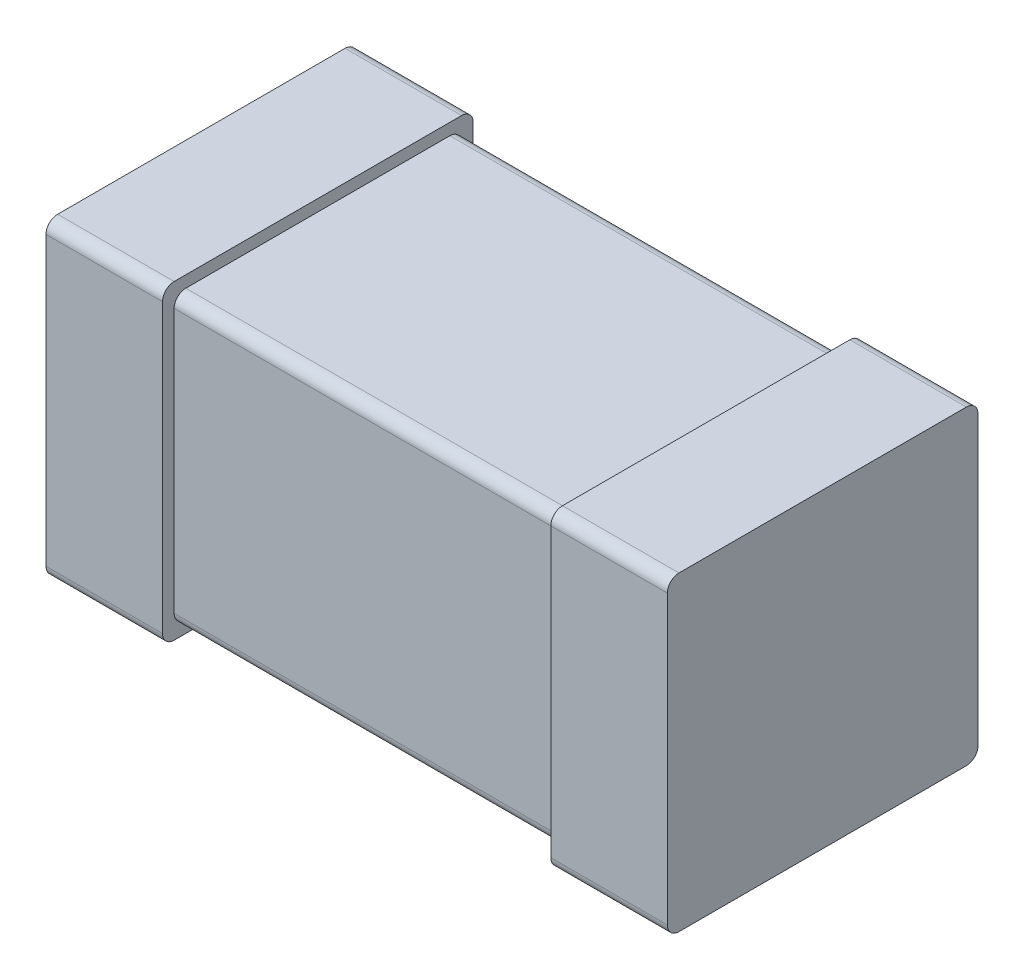
ISO-10303-21;
HEADER;
FILE_DESCRIPTION(('STEP AP214'),'2;1');
FILE_NAME('part.step','',(''),(''),'','','');
FILE_SCHEMA(('AUTOMOTIVE_DESIGN { 1 0 10303 214 1 1 1 1 }'));
ENDSEC;
DATA;
#1=APPLICATION_CONTEXT('core data for automotive mechanical design processes');
#2=APPLICATION_PROTOCOL_DEFINITION('international standard','automotive_design',2000,#1);
#3=PRODUCT_CONTEXT('',#1,'mechanical');
#4=PRODUCT('Part','Part','',(#3));
#5=PRODUCT_RELATED_PRODUCT_CATEGORY('part','',(#4));
#6=PRODUCT_DEFINITION_FORMATION('','',#4);
#7=PRODUCT_DEFINITION_CONTEXT('part definition',#1,'design');
#8=PRODUCT_DEFINITION('design','',#6,#7);
#9=PRODUCT_DEFINITION_SHAPE('','',#8);
#10=(LENGTH_UNIT() NAMED_UNIT(*) SI_UNIT(.MILLI.,.METRE.));
#11=(NAMED_UNIT(*) PLANE_ANGLE_UNIT() SI_UNIT($,.RADIAN.));
#12=(NAMED_UNIT(*) SI_UNIT($,.STERADIAN.) SOLID_ANGLE_UNIT());
#13=UNCERTAINTY_MEASURE_WITH_UNIT(LENGTH_MEASURE(1.E-05),#10,'distance_accuracy_value','');
#14=(GEOMETRIC_REPRESENTATION_CONTEXT(3) GLOBAL_UNCERTAINTY_ASSIGNED_CONTEXT((#13)) GLOBAL_UNIT_ASSIGNED_CONTEXT((#10,
#11,#12)) REPRESENTATION_CONTEXT('',''));
#15=CARTESIAN_POINT('',(0.,0.,0.));
#16=DIRECTION('',(0.,0.,1.));
#17=DIRECTION('',(1.,0.,0.));
#18=AXIS2_PLACEMENT_3D('',#15,#16,#17);
#19=CARTESIAN_POINT('',(0.8,-0.4,0.));
#20=DIRECTION('',(1.,0.,0.));
#21=DIRECTION('',(0.,1.,0.));
#22=AXIS2_PLACEMENT_3D('',#19,#20,#21);
#23=PLANE('',#22);
#24=DIRECTION('',(0.,0.,1.));
#25=VECTOR('',#24,1.);
#26=CARTESIAN_POINT('',(0.8,-0.4,0.));
#27=LINE('',#26,#25);
#28=CARTESIAN_POINT('',(0.8,-0.4,0.03));
#29=VERTEX_POINT('',#28);
#30=CARTESIAN_POINT('',(0.8,-0.4,0.77));
#31=VERTEX_POINT('',#30);
#32=EDGE_CURVE('E300',#29,#31,#27,.T.);
#33=ORIENTED_EDGE('',*,*,#32,.F.);
#34=CARTESIAN_POINT('',(0.8,-0.37,0.03));
#35=DIRECTION('',(1.,0.,0.));
#36=DIRECTION('',(0.,0.,1.));
#37=AXIS2_PLACEMENT_3D('',#34,#35,#36);
#38=CIRCLE('',#37,0.03);
#39=CARTESIAN_POINT('',(0.8,-0.37,0.));
#40=VERTEX_POINT('',#39);
#41=EDGE_CURVE('E380',#29,#40,#38,.T.);
#42=ORIENTED_EDGE('',*,*,#41,.T.);
#43=DIRECTION('',(0.,1.,0.));
#44=VECTOR('',#43,1.);
#45=CARTESIAN_POINT('',(0.8,-0.4,0.));
#46=LINE('',#45,#44);
#47=CARTESIAN_POINT('',(0.8,0.37,0.));
#48=VERTEX_POINT('',#47);
#49=EDGE_CURVE('E406',#40,#48,#46,.T.);
#50=ORIENTED_EDGE('',*,*,#49,.T.);
#51=CARTESIAN_POINT('',(0.8,0.37,0.03));
#52=DIRECTION('',(-1.,0.,0.));
#53=DIRECTION('',(0.,0.,1.));
#54=AXIS2_PLACEMENT_3D('',#51,#52,#53);
#55=CIRCLE('',#54,0.03);
#56=CARTESIAN_POINT('',(0.8,0.4,0.03));
#57=VERTEX_POINT('',#56);
#58=EDGE_CURVE('E289',#57,#48,#55,.T.);
#59=ORIENTED_EDGE('',*,*,#58,.F.);
#60=DIRECTION('',(0.,0.,1.));
#61=VECTOR('',#60,1.);
#62=CARTESIAN_POINT('',(0.8,0.4,0.));
#63=LINE('',#62,#61);
#64=CARTESIAN_POINT('',(0.8,0.4,0.77));
#65=VERTEX_POINT('',#64);
#66=EDGE_CURVE('E11',#57,#65,#63,.T.);
#67=ORIENTED_EDGE('',*,*,#66,.T.);
#68=CARTESIAN_POINT('',(0.8,0.37,0.77));
#69=DIRECTION('',(1.,0.,0.));
#70=DIRECTION('',(0.,0.,1.));
#71=AXIS2_PLACEMENT_3D('',#68,#69,#70);
#72=CIRCLE('',#71,0.03);
#73=CARTESIAN_POINT('',(0.8,0.37,0.8));
#74=VERTEX_POINT('',#73);
#75=EDGE_CURVE('E20',#65,#74,#72,.T.);
#76=ORIENTED_EDGE('',*,*,#75,.T.);
#77=DIRECTION('',(0.,1.,0.));
#78=VECTOR('',#77,1.);
#79=CARTESIAN_POINT('',(0.8,-0.4,0.8));
#80=LINE('',#79,#78);
#81=CARTESIAN_POINT('',(0.8,-0.37,0.8));
#82=VERTEX_POINT('',#81);
#83=EDGE_CURVE('E407',#82,#74,#80,.T.);
#84=ORIENTED_EDGE('',*,*,#83,.F.);
#85=CARTESIAN_POINT('',(0.8,-0.37,0.77));
#86=DIRECTION('',(-1.,0.,0.));
#87=DIRECTION('',(0.,0.,1.));
#88=AXIS2_PLACEMENT_3D('',#85,#86,#87);
#89=CIRCLE('',#88,0.03);
#90=EDGE_CURVE('E391',#31,#82,#89,.T.);
#91=ORIENTED_EDGE('',*,*,#90,.F.);
#92=EDGE_LOOP('',(#33,#42,#50,#59,#67,#76,#84,#91));
#93=FACE_BOUND('',#92,.T.);
#94=ADVANCED_FACE('F17',(#93),#23,.T.);
#95=CARTESIAN_POINT('',(0.5,0.4,0.));
#96=DIRECTION('',(0.,1.,0.));
#97=DIRECTION('',(1.,0.,0.));
#98=AXIS2_PLACEMENT_3D('',#95,#96,#97);
#99=PLANE('',#98);
#100=ORIENTED_EDGE('',*,*,#66,.F.);
#101=DIRECTION('',(1.,0.,0.));
#102=VECTOR('',#101,1.);
#103=CARTESIAN_POINT('',(0.5,0.4,0.03));
#104=LINE('',#103,#102);
#105=CARTESIAN_POINT('',(0.5,0.4,0.03));
#106=VERTEX_POINT('',#105);
#107=EDGE_CURVE('E285',#106,#57,#104,.T.);
#108=ORIENTED_EDGE('',*,*,#107,.F.);
#109=DIRECTION('',(0.,0.,1.));
#110=VECTOR('',#109,1.);
#111=CARTESIAN_POINT('',(0.5,0.4,0.));
#112=LINE('',#111,#110);
#113=CARTESIAN_POINT('',(0.5,0.4,0.77));
#114=VERTEX_POINT('',#113);
#115=EDGE_CURVE('E369',#106,#114,#112,.T.);
#116=ORIENTED_EDGE('',*,*,#115,.T.);
#117=DIRECTION('',(1.,0.,0.));
#118=VECTOR('',#117,1.);
#119=CARTESIAN_POINT('',(0.5,0.4,0.77));
#120=LINE('',#119,#118);
#121=EDGE_CURVE('E26',#114,#65,#120,.T.);
#122=ORIENTED_EDGE('',*,*,#121,.T.);
#123=EDGE_LOOP('',(#100,#108,#116,#122));
#124=FACE_BOUND('',#123,.T.);
#125=ADVANCED_FACE('F569',(#124),#99,.T.);
#126=CARTESIAN_POINT('',(0.5,0.37,0.77));
#127=DIRECTION('',(1.,0.,0.));
#128=DIRECTION('',(0.,1.,0.));
#129=AXIS2_PLACEMENT_3D('',#126,#127,#128);
#130=CYLINDRICAL_SURFACE('',#129,0.03);
#131=CARTESIAN_POINT('',(0.5,0.37,0.77));
#132=DIRECTION('',(1.,0.,0.));
#133=DIRECTION('',(0.,0.,1.));
#134=AXIS2_PLACEMENT_3D('',#131,#132,#133);
#135=CIRCLE('',#134,0.03);
#136=CARTESIAN_POINT('',(0.5,0.37,0.8));
#137=VERTEX_POINT('',#136);
#138=EDGE_CURVE('E365',#114,#137,#135,.T.);
#139=ORIENTED_EDGE('',*,*,#138,.T.);
#140=DIRECTION('',(1.,0.,0.));
#141=VECTOR('',#140,1.);
#142=CARTESIAN_POINT('',(0.5,0.37,0.8));
#143=LINE('',#142,#141);
#144=EDGE_CURVE('E290',#137,#74,#143,.T.);
#145=ORIENTED_EDGE('',*,*,#144,.T.);
#146=ORIENTED_EDGE('',*,*,#75,.F.);
#147=ORIENTED_EDGE('',*,*,#121,.F.);
#148=EDGE_LOOP('',(#139,#145,#146,#147));
#149=FACE_BOUND('',#148,.T.);
#150=ADVANCED_FACE('F573',(#149),#130,.T.);
#151=CARTESIAN_POINT('',(0.5,0.37,0.03));
#152=DIRECTION('',(1.,0.,0.));
#153=DIRECTION('',(0.,1.,0.));
#154=AXIS2_PLACEMENT_3D('',#151,#152,#153);
#155=CYLINDRICAL_SURFACE('',#154,0.03);
#156=ORIENTED_EDGE('',*,*,#107,.T.);
#157=ORIENTED_EDGE('',*,*,#58,.T.);
#158=DIRECTION('',(1.,0.,0.));
#159=VECTOR('',#158,1.);
#160=CARTESIAN_POINT('',(0.5,0.37,0.));
#161=LINE('',#160,#159);
#162=CARTESIAN_POINT('',(0.5,0.37,0.));
#163=VERTEX_POINT('',#162);
#164=EDGE_CURVE('E402',#163,#48,#161,.T.);
#165=ORIENTED_EDGE('',*,*,#164,.F.);
#166=CARTESIAN_POINT('',(0.5,0.37,0.03));
#167=DIRECTION('',(-1.,0.,0.));
#168=DIRECTION('',(0.,0.,1.));
#169=AXIS2_PLACEMENT_3D('',#166,#167,#168);
#170=CIRCLE('',#169,0.03);
#171=EDGE_CURVE('E340',#106,#163,#170,.T.);
#172=ORIENTED_EDGE('',*,*,#171,.F.);
#173=EDGE_LOOP('',(#156,#157,#165,#172));
#174=FACE_BOUND('',#173,.T.);
#175=ADVANCED_FACE('F585',(#174),#155,.T.);
#176=CARTESIAN_POINT('',(0.5,-0.4,0.8));
#177=DIRECTION('',(0.,0.,1.));
#178=DIRECTION('',(1.,0.,0.));
#179=AXIS2_PLACEMENT_3D('',#176,#177,#178);
#180=PLANE('',#179);
#181=DIRECTION('',(0.,1.,0.));
#182=VECTOR('',#181,1.);
#183=CARTESIAN_POINT('',(0.5,-0.4,0.8));
#184=LINE('',#183,#182);
#185=CARTESIAN_POINT('',(0.5,-0.37,0.8));
#186=VERTEX_POINT('',#185);
#187=EDGE_CURVE('E361',#186,#137,#184,.T.);
#188=ORIENTED_EDGE('',*,*,#187,.F.);
#189=DIRECTION('',(1.,0.,0.));
#190=VECTOR('',#189,1.);
#191=CARTESIAN_POINT('',(0.5,-0.37,0.8));
#192=LINE('',#191,#190);
#193=EDGE_CURVE('E395',#186,#82,#192,.T.);
#194=ORIENTED_EDGE('',*,*,#193,.T.);
#195=ORIENTED_EDGE('',*,*,#83,.T.);
#196=ORIENTED_EDGE('',*,*,#144,.F.);
#197=EDGE_LOOP('',(#188,#194,#195,#196));
#198=FACE_BOUND('',#197,.T.);
#199=ADVANCED_FACE('F591',(#198),#180,.T.);
#200=CARTESIAN_POINT('',(0.5,-0.4,0.));
#201=DIRECTION('',(0.,0.,1.));
#202=DIRECTION('',(1.,0.,0.));
#203=AXIS2_PLACEMENT_3D('',#200,#201,#202);
#204=PLANE('',#203);
#205=ORIENTED_EDGE('',*,*,#164,.T.);
#206=ORIENTED_EDGE('',*,*,#49,.F.);
#207=DIRECTION('',(1.,0.,0.));
#208=VECTOR('',#207,1.);
#209=CARTESIAN_POINT('',(0.5,-0.37,0.));
#210=LINE('',#209,#208);
#211=CARTESIAN_POINT('',(0.5,-0.37,0.));
#212=VERTEX_POINT('',#211);
#213=EDGE_CURVE('E304',#212,#40,#210,.T.);
#214=ORIENTED_EDGE('',*,*,#213,.F.);
#215=DIRECTION('',(0.,1.,0.));
#216=VECTOR('',#215,1.);
#217=CARTESIAN_POINT('',(0.5,-0.4,0.));
#218=LINE('',#217,#216);
#219=EDGE_CURVE('E335',#212,#163,#218,.T.);
#220=ORIENTED_EDGE('',*,*,#219,.T.);
#221=EDGE_LOOP('',(#205,#206,#214,#220));
#222=FACE_BOUND('',#221,.T.);
#223=ADVANCED_FACE('F583',(#222),#204,.F.);
#224=CARTESIAN_POINT('',(0.5,-0.37,0.77));
#225=DIRECTION('',(1.,0.,0.));
#226=DIRECTION('',(0.,-1.,0.));
#227=AXIS2_PLACEMENT_3D('',#224,#225,#226);
#228=CYLINDRICAL_SURFACE('',#227,0.03);
#229=DIRECTION('',(1.,0.,0.));
#230=VECTOR('',#229,1.);
#231=CARTESIAN_POINT('',(0.5,-0.4,0.77));
#232=LINE('',#231,#230);
#233=CARTESIAN_POINT('',(0.5,-0.4,0.77));
#234=VERTEX_POINT('',#233);
#235=EDGE_CURVE('E384',#234,#31,#232,.T.);
#236=ORIENTED_EDGE('',*,*,#235,.T.);
#237=ORIENTED_EDGE('',*,*,#90,.T.);
#238=ORIENTED_EDGE('',*,*,#193,.F.);
#239=CARTESIAN_POINT('',(0.5,-0.37,0.77));
#240=DIRECTION('',(-1.,0.,0.));
#241=DIRECTION('',(0.,0.,1.));
#242=AXIS2_PLACEMENT_3D('',#239,#240,#241);
#243=CIRCLE('',#242,0.03);
#244=EDGE_CURVE('E357',#234,#186,#243,.T.);
#245=ORIENTED_EDGE('',*,*,#244,.F.);
#246=EDGE_LOOP('',(#236,#237,#238,#245));
#247=FACE_BOUND('',#246,.T.);
#248=ADVANCED_FACE('F594',(#247),#228,.T.);
#249=CARTESIAN_POINT('',(0.5,-0.37,0.03));
#250=DIRECTION('',(1.,0.,0.));
#251=DIRECTION('',(0.,-1.,0.));
#252=AXIS2_PLACEMENT_3D('',#249,#250,#251);
#253=CYLINDRICAL_SURFACE('',#252,0.03);
#254=CARTESIAN_POINT('',(0.5,-0.37,0.03));
#255=DIRECTION('',(1.,0.,0.));
#256=DIRECTION('',(0.,0.,1.));
#257=AXIS2_PLACEMENT_3D('',#254,#255,#256);
#258=CIRCLE('',#257,0.03);
#259=CARTESIAN_POINT('',(0.5,-0.4,0.03));
#260=VERTEX_POINT('',#259);
#261=EDGE_CURVE('E339',#260,#212,#258,.T.);
#262=ORIENTED_EDGE('',*,*,#261,.T.);
#263=ORIENTED_EDGE('',*,*,#213,.T.);
#264=ORIENTED_EDGE('',*,*,#41,.F.);
#265=DIRECTION('',(1.,0.,0.));
#266=VECTOR('',#265,1.);
#267=CARTESIAN_POINT('',(0.5,-0.4,0.03));
#268=LINE('',#267,#266);
#269=EDGE_CURVE('E305',#260,#29,#268,.T.);
#270=ORIENTED_EDGE('',*,*,#269,.F.);
#271=EDGE_LOOP('',(#262,#263,#264,#270));
#272=FACE_BOUND('',#271,.T.);
#273=ADVANCED_FACE('F580',(#272),#253,.T.);
#274=CARTESIAN_POINT('',(0.5,-0.4,0.));
#275=DIRECTION('',(0.,1.,0.));
#276=DIRECTION('',(1.,0.,0.));
#277=AXIS2_PLACEMENT_3D('',#274,#275,#276);
#278=PLANE('',#277);
#279=ORIENTED_EDGE('',*,*,#235,.F.);
#280=DIRECTION('',(0.,0.,1.));
#281=VECTOR('',#280,1.);
#282=CARTESIAN_POINT('',(0.5,-0.4,0.));
#283=LINE('',#282,#281);
#284=EDGE_CURVE('E376',#260,#234,#283,.T.);
#285=ORIENTED_EDGE('',*,*,#284,.F.);
#286=ORIENTED_EDGE('',*,*,#269,.T.);
#287=ORIENTED_EDGE('',*,*,#32,.T.);
#288=EDGE_LOOP('',(#279,#285,#286,#287));
#289=FACE_BOUND('',#288,.T.);
#290=ADVANCED_FACE('F577',(#289),#278,.F.);
#291=CARTESIAN_POINT('',(0.5,-0.4,0.));
#292=DIRECTION('',(1.,0.,0.));
#293=DIRECTION('',(0.,1.,0.));
#294=AXIS2_PLACEMENT_3D('',#291,#292,#293);
#295=PLANE('',#294);
#296=DIRECTION('',(0.,1.,0.));
#297=VECTOR('',#296,1.);
#298=CARTESIAN_POINT('',(0.5,-0.37,0.03));
#299=LINE('',#298,#297);
#300=CARTESIAN_POINT('',(0.5,-0.34,0.03));
#301=VERTEX_POINT('',#300);
#302=CARTESIAN_POINT('',(0.5,0.34,0.03));
#303=VERTEX_POINT('',#302);
#304=EDGE_CURVE('E310',#301,#303,#299,.T.);
#305=ORIENTED_EDGE('',*,*,#304,.T.);
#306=CARTESIAN_POINT('',(0.5,0.34,0.06));
#307=DIRECTION('',(-1.,0.,0.));
#308=DIRECTION('',(0.,0.,1.));
#309=AXIS2_PLACEMENT_3D('',#306,#307,#308);
#310=CIRCLE('',#309,0.03);
#311=CARTESIAN_POINT('',(0.5,0.37,0.06));
#312=VERTEX_POINT('',#311);
#313=EDGE_CURVE('E318',#312,#303,#310,.T.);
#314=ORIENTED_EDGE('',*,*,#313,.F.);
#315=DIRECTION('',(0.,0.,1.));
#316=VECTOR('',#315,1.);
#317=CARTESIAN_POINT('',(0.5,0.37,0.03));
#318=LINE('',#317,#316);
#319=CARTESIAN_POINT('',(0.5,0.37,0.74));
#320=VERTEX_POINT('',#319);
#321=EDGE_CURVE('E321',#312,#320,#318,.T.);
#322=ORIENTED_EDGE('',*,*,#321,.T.);
#323=CARTESIAN_POINT('',(0.5,0.34,0.74));
#324=DIRECTION('',(1.,0.,0.));
#325=DIRECTION('',(0.,0.,1.));
#326=AXIS2_PLACEMENT_3D('',#323,#324,#325);
#327=CIRCLE('',#326,0.03);
#328=CARTESIAN_POINT('',(0.5,0.34,0.77));
#329=VERTEX_POINT('',#328);
#330=EDGE_CURVE('E330',#320,#329,#327,.T.);
#331=ORIENTED_EDGE('',*,*,#330,.T.);
#332=DIRECTION('',(0.,1.,0.));
#333=VECTOR('',#332,1.);
#334=CARTESIAN_POINT('',(0.5,-0.37,0.77));
#335=LINE('',#334,#333);
#336=CARTESIAN_POINT('',(0.5,-0.34,0.77));
#337=VERTEX_POINT('',#336);
#338=EDGE_CURVE('E344',#337,#329,#335,.T.);
#339=ORIENTED_EDGE('',*,*,#338,.F.);
#340=CARTESIAN_POINT('',(0.5,-0.34,0.74));
#341=DIRECTION('',(-1.,0.,0.));
#342=DIRECTION('',(0.,0.,1.));
#343=AXIS2_PLACEMENT_3D('',#340,#341,#342);
#344=CIRCLE('',#343,0.03);
#345=CARTESIAN_POINT('',(0.5,-0.37,0.74));
#346=VERTEX_POINT('',#345);
#347=EDGE_CURVE('E351',#346,#337,#344,.T.);
#348=ORIENTED_EDGE('',*,*,#347,.F.);
#349=DIRECTION('',(0.,0.,1.));
#350=VECTOR('',#349,1.);
#351=CARTESIAN_POINT('',(0.5,-0.37,0.03));
#352=LINE('',#351,#350);
#353=CARTESIAN_POINT('',(0.5,-0.37,0.06));
#354=VERTEX_POINT('',#353);
#355=EDGE_CURVE('E354',#354,#346,#352,.T.);
#356=ORIENTED_EDGE('',*,*,#355,.F.);
#357=CARTESIAN_POINT('',(0.5,-0.34,0.06));
#358=DIRECTION('',(1.,0.,0.));
#359=DIRECTION('',(0.,0.,1.));
#360=AXIS2_PLACEMENT_3D('',#357,#358,#359);
#361=CIRCLE('',#360,0.03);
#362=EDGE_CURVE('E295',#354,#301,#361,.T.);
#363=ORIENTED_EDGE('',*,*,#362,.T.);
#364=EDGE_LOOP('',(#305,#314,#322,#331,#339,#348,#356,#363));
#365=FACE_BOUND('',#364,.T.);
#366=ORIENTED_EDGE('',*,*,#244,.T.);
#367=ORIENTED_EDGE('',*,*,#187,.T.);
#368=ORIENTED_EDGE('',*,*,#138,.F.);
#369=ORIENTED_EDGE('',*,*,#115,.F.);
#370=ORIENTED_EDGE('',*,*,#171,.T.);
#371=ORIENTED_EDGE('',*,*,#219,.F.);
#372=ORIENTED_EDGE('',*,*,#261,.F.);
#373=ORIENTED_EDGE('',*,*,#284,.T.);
#374=EDGE_LOOP('',(#366,#367,#368,#369,#370,#371,#372,#373));
#375=FACE_BOUND('',#374,.T.);
#376=ADVANCED_FACE('F541',(#365,#375),#295,.F.);
#377=CARTESIAN_POINT('',(-0.5,-0.37,0.03));
#378=DIRECTION('',(0.,1.,0.));
#379=DIRECTION('',(1.,0.,0.));
#380=AXIS2_PLACEMENT_3D('',#377,#378,#379);
#381=PLANE('',#380);
#382=DIRECTION('',(1.,0.,0.));
#383=VECTOR('',#382,1.);
#384=CARTESIAN_POINT('',(-0.5,-0.37,0.74));
#385=LINE('',#384,#383);
#386=CARTESIAN_POINT('',(-0.5,-0.37,0.74));
#387=VERTEX_POINT('',#386);
#388=EDGE_CURVE('E347',#387,#346,#385,.T.);
#389=ORIENTED_EDGE('',*,*,#388,.F.);
#390=DIRECTION('',(0.,0.,1.));
#391=VECTOR('',#390,1.);
#392=CARTESIAN_POINT('',(-0.5,-0.37,0.03));
#393=LINE('',#392,#391);
#394=CARTESIAN_POINT('',(-0.5,-0.37,0.06));
#395=VERTEX_POINT('',#394);
#396=EDGE_CURVE('E268',#395,#387,#393,.T.);
#397=ORIENTED_EDGE('',*,*,#396,.F.);
#398=DIRECTION('',(1.,0.,0.));
#399=VECTOR('',#398,1.);
#400=CARTESIAN_POINT('',(-0.5,-0.37,0.06));
#401=LINE('',#400,#399);
#402=EDGE_CURVE('E299',#395,#354,#401,.T.);
#403=ORIENTED_EDGE('',*,*,#402,.T.);
#404=ORIENTED_EDGE('',*,*,#355,.T.);
#405=EDGE_LOOP('',(#389,#397,#403,#404));
#406=FACE_BOUND('',#405,.T.);
#407=ADVANCED_FACE('F547',(#406),#381,.F.);
#408=CARTESIAN_POINT('',(-0.5,-0.34,0.74));
#409=DIRECTION('',(1.,0.,0.));
#410=DIRECTION('',(0.,-1.,0.));
#411=AXIS2_PLACEMENT_3D('',#408,#409,#410);
#412=CYLINDRICAL_SURFACE('',#411,0.03);
#413=ORIENTED_EDGE('',*,*,#388,.T.);
#414=ORIENTED_EDGE('',*,*,#347,.T.);
#415=DIRECTION('',(1.,0.,0.));
#416=VECTOR('',#415,1.);
#417=CARTESIAN_POINT('',(-0.5,-0.34,0.77));
#418=LINE('',#417,#416);
#419=CARTESIAN_POINT('',(-0.5,-0.34,0.77));
#420=VERTEX_POINT('',#419);
#421=EDGE_CURVE('E334',#420,#337,#418,.T.);
#422=ORIENTED_EDGE('',*,*,#421,.F.);
#423=CARTESIAN_POINT('',(-0.5,-0.34,0.74));
#424=DIRECTION('',(-1.,0.,0.));
#425=DIRECTION('',(0.,0.,1.));
#426=AXIS2_PLACEMENT_3D('',#423,#424,#425);
#427=CIRCLE('',#426,0.03);
#428=EDGE_CURVE('E263',#387,#420,#427,.T.);
#429=ORIENTED_EDGE('',*,*,#428,.F.);
#430=EDGE_LOOP('',(#413,#414,#422,#429));
#431=FACE_BOUND('',#430,.T.);
#432=ADVANCED_FACE('F551',(#431),#412,.T.);
#433=CARTESIAN_POINT('',(-0.5,-0.37,0.77));
#434=DIRECTION('',(0.,0.,1.));
#435=DIRECTION('',(1.,0.,0.));
#436=AXIS2_PLACEMENT_3D('',#433,#434,#435);
#437=PLANE('',#436);
#438=DIRECTION('',(0.,1.,0.));
#439=VECTOR('',#438,1.);
#440=CARTESIAN_POINT('',(-0.5,-0.37,0.77));
#441=LINE('',#440,#439);
#442=CARTESIAN_POINT('',(-0.5,0.34,0.77));
#443=VERTEX_POINT('',#442);
#444=EDGE_CURVE('E267',#420,#443,#441,.T.);
#445=ORIENTED_EDGE('',*,*,#444,.F.);
#446=ORIENTED_EDGE('',*,*,#421,.T.);
#447=ORIENTED_EDGE('',*,*,#338,.T.);
#448=DIRECTION('',(1.,0.,0.));
#449=VECTOR('',#448,1.);
#450=CARTESIAN_POINT('',(-0.5,0.34,0.77));
#451=LINE('',#450,#449);
#452=EDGE_CURVE('E329',#443,#329,#451,.T.);
#453=ORIENTED_EDGE('',*,*,#452,.F.);
#454=EDGE_LOOP('',(#445,#446,#447,#453));
#455=FACE_BOUND('',#454,.T.);
#456=ADVANCED_FACE('F553',(#455),#437,.T.);
#457=CARTESIAN_POINT('',(-0.5,0.34,0.74));
#458=DIRECTION('',(1.,0.,0.));
#459=DIRECTION('',(0.,1.,0.));
#460=AXIS2_PLACEMENT_3D('',#457,#458,#459);
#461=CYLINDRICAL_SURFACE('',#460,0.03);
#462=CARTESIAN_POINT('',(-0.5,0.34,0.74));
#463=DIRECTION('',(1.,0.,0.));
#464=DIRECTION('',(0.,0.,1.));
#465=AXIS2_PLACEMENT_3D('',#462,#463,#464);
#466=CIRCLE('',#465,0.03);
#467=CARTESIAN_POINT('',(-0.5,0.37,0.74));
#468=VERTEX_POINT('',#467);
#469=EDGE_CURVE('E272',#468,#443,#466,.T.);
#470=ORIENTED_EDGE('',*,*,#469,.T.);
#471=ORIENTED_EDGE('',*,*,#452,.T.);
#472=ORIENTED_EDGE('',*,*,#330,.F.);
#473=DIRECTION('',(1.,0.,0.));
#474=VECTOR('',#473,1.);
#475=CARTESIAN_POINT('',(-0.5,0.37,0.74));
#476=LINE('',#475,#474);
#477=EDGE_CURVE('E325',#468,#320,#476,.T.);
#478=ORIENTED_EDGE('',*,*,#477,.F.);
#479=EDGE_LOOP('',(#470,#471,#472,#478));
#480=FACE_BOUND('',#479,.T.);
#481=ADVANCED_FACE('F555',(#480),#461,.T.);
#482=CARTESIAN_POINT('',(-0.5,0.37,0.03));
#483=DIRECTION('',(0.,1.,0.));
#484=DIRECTION('',(1.,0.,0.));
#485=AXIS2_PLACEMENT_3D('',#482,#483,#484);
#486=PLANE('',#485);
#487=ORIENTED_EDGE('',*,*,#321,.F.);
#488=DIRECTION('',(1.,0.,0.));
#489=VECTOR('',#488,1.);
#490=CARTESIAN_POINT('',(-0.5,0.37,0.06));
#491=LINE('',#490,#489);
#492=CARTESIAN_POINT('',(-0.5,0.37,0.06));
#493=VERTEX_POINT('',#492);
#494=EDGE_CURVE('E314',#493,#312,#491,.T.);
#495=ORIENTED_EDGE('',*,*,#494,.F.);
#496=DIRECTION('',(0.,0.,1.));
#497=VECTOR('',#496,1.);
#498=CARTESIAN_POINT('',(-0.5,0.37,0.03));
#499=LINE('',#498,#497);
#500=EDGE_CURVE('E276',#493,#468,#499,.T.);
#501=ORIENTED_EDGE('',*,*,#500,.T.);
#502=ORIENTED_EDGE('',*,*,#477,.T.);
#503=EDGE_LOOP('',(#487,#495,#501,#502));
#504=FACE_BOUND('',#503,.T.);
#505=ADVANCED_FACE('F557',(#504),#486,.T.);
#506=CARTESIAN_POINT('',(-0.5,0.34,0.06));
#507=DIRECTION('',(1.,0.,0.));
#508=DIRECTION('',(0.,1.,0.));
#509=AXIS2_PLACEMENT_3D('',#506,#507,#508);
#510=CYLINDRICAL_SURFACE('',#509,0.03);
#511=ORIENTED_EDGE('',*,*,#494,.T.);
#512=ORIENTED_EDGE('',*,*,#313,.T.);
#513=DIRECTION('',(1.,0.,0.));
#514=VECTOR('',#513,1.);
#515=CARTESIAN_POINT('',(-0.5,0.34,0.03));
#516=LINE('',#515,#514);
#517=CARTESIAN_POINT('',(-0.5,0.34,0.03));
#518=VERTEX_POINT('',#517);
#519=EDGE_CURVE('E306',#518,#303,#516,.T.);
#520=ORIENTED_EDGE('',*,*,#519,.F.);
#521=CARTESIAN_POINT('',(-0.5,0.34,0.06));
#522=DIRECTION('',(-1.,0.,0.));
#523=DIRECTION('',(0.,0.,1.));
#524=AXIS2_PLACEMENT_3D('',#521,#522,#523);
#525=CIRCLE('',#524,0.03);
#526=EDGE_CURVE('E280',#493,#518,#525,.T.);
#527=ORIENTED_EDGE('',*,*,#526,.F.);
#528=EDGE_LOOP('',(#511,#512,#520,#527));
#529=FACE_BOUND('',#528,.T.);
#530=ADVANCED_FACE('F538',(#529),#510,.T.);
#531=CARTESIAN_POINT('',(-0.5,-0.37,0.03));
#532=DIRECTION('',(0.,0.,1.));
#533=DIRECTION('',(1.,0.,0.));
#534=AXIS2_PLACEMENT_3D('',#531,#532,#533);
#535=PLANE('',#534);
#536=ORIENTED_EDGE('',*,*,#519,.T.);
#537=ORIENTED_EDGE('',*,*,#304,.F.);
#538=DIRECTION('',(1.,0.,0.));
#539=VECTOR('',#538,1.);
#540=CARTESIAN_POINT('',(-0.5,-0.34,0.03));
#541=LINE('',#540,#539);
#542=CARTESIAN_POINT('',(-0.5,-0.34,0.03));
#543=VERTEX_POINT('',#542);
#544=EDGE_CURVE('E294',#543,#301,#541,.T.);
#545=ORIENTED_EDGE('',*,*,#544,.F.);
#546=DIRECTION('',(0.,1.,0.));
#547=VECTOR('',#546,1.);
#548=CARTESIAN_POINT('',(-0.5,-0.37,0.03));
#549=LINE('',#548,#547);
#550=EDGE_CURVE('E283',#543,#518,#549,.T.);
#551=ORIENTED_EDGE('',*,*,#550,.T.);
#552=EDGE_LOOP('',(#536,#537,#545,#551));
#553=FACE_BOUND('',#552,.T.);
#554=ADVANCED_FACE('F532',(#553),#535,.F.);
#555=CARTESIAN_POINT('',(-0.5,-0.34,0.06));
#556=DIRECTION('',(1.,0.,0.));
#557=DIRECTION('',(0.,-1.,0.));
#558=AXIS2_PLACEMENT_3D('',#555,#556,#557);
#559=CYLINDRICAL_SURFACE('',#558,0.03);
#560=CARTESIAN_POINT('',(-0.5,-0.34,0.06));
#561=DIRECTION('',(1.,0.,0.));
#562=DIRECTION('',(0.,0.,1.));
#563=AXIS2_PLACEMENT_3D('',#560,#561,#562);
#564=CIRCLE('',#563,0.03);
#565=EDGE_CURVE('E240',#395,#543,#564,.T.);
#566=ORIENTED_EDGE('',*,*,#565,.T.);
#567=ORIENTED_EDGE('',*,*,#544,.T.);
#568=ORIENTED_EDGE('',*,*,#362,.F.);
#569=ORIENTED_EDGE('',*,*,#402,.F.);
#570=EDGE_LOOP('',(#566,#567,#568,#569));
#571=FACE_BOUND('',#570,.T.);
#572=ADVANCED_FACE('F528',(#571),#559,.T.);
#573=CARTESIAN_POINT('',(-0.5,-0.4,0.));
#574=DIRECTION('',(1.,0.,0.));
#575=DIRECTION('',(0.,1.,0.));
#576=AXIS2_PLACEMENT_3D('',#573,#574,#575);
#577=PLANE('',#576);
#578=ORIENTED_EDGE('',*,*,#565,.F.);
#579=ORIENTED_EDGE('',*,*,#396,.T.);
#580=ORIENTED_EDGE('',*,*,#428,.T.);
#581=ORIENTED_EDGE('',*,*,#444,.T.);
#582=ORIENTED_EDGE('',*,*,#469,.F.);
#583=ORIENTED_EDGE('',*,*,#500,.F.);
#584=ORIENTED_EDGE('',*,*,#526,.T.);
#585=ORIENTED_EDGE('',*,*,#550,.F.);
#586=EDGE_LOOP('',(#578,#579,#580,#581,#582,#583,#584,#585));
#587=FACE_BOUND('',#586,.T.);
#588=DIRECTION('',(0.,0.,1.));
#589=VECTOR('',#588,1.);
#590=CARTESIAN_POINT('',(-0.5,-0.4,0.));
#591=LINE('',#590,#589);
#592=CARTESIAN_POINT('',(-0.5,-0.4,0.03));
#593=VERTEX_POINT('',#592);
#594=CARTESIAN_POINT('',(-0.5,-0.4,0.77));
#595=VERTEX_POINT('',#594);
#596=EDGE_CURVE('E450',#593,#595,#591,.T.);
#597=ORIENTED_EDGE('',*,*,#596,.F.);
#598=CARTESIAN_POINT('',(-0.5,-0.37,0.03));
#599=DIRECTION('',(1.,0.,0.));
#600=DIRECTION('',(0.,0.,1.));
#601=AXIS2_PLACEMENT_3D('',#598,#599,#600);
#602=CIRCLE('',#601,0.03);
#603=CARTESIAN_POINT('',(-0.5,-0.37,0.));
#604=VERTEX_POINT('',#603);
#605=EDGE_CURVE('E436',#593,#604,#602,.T.);
#606=ORIENTED_EDGE('',*,*,#605,.T.);
#607=DIRECTION('',(0.,1.,0.));
#608=VECTOR('',#607,1.);
#609=CARTESIAN_POINT('',(-0.5,-0.4,0.));
#610=LINE('',#609,#608);
#611=CARTESIAN_POINT('',(-0.5,0.37,0.));
#612=VERTEX_POINT('',#611);
#613=EDGE_CURVE('E488',#604,#612,#610,.T.);
#614=ORIENTED_EDGE('',*,*,#613,.T.);
#615=CARTESIAN_POINT('',(-0.5,0.37,0.03));
#616=DIRECTION('',(-1.,0.,0.));
#617=DIRECTION('',(0.,0.,1.));
#618=AXIS2_PLACEMENT_3D('',#615,#616,#617);
#619=CIRCLE('',#618,0.03);
#620=CARTESIAN_POINT('',(-0.5,0.4,0.03));
#621=VERTEX_POINT('',#620);
#622=EDGE_CURVE('E236',#621,#612,#619,.T.);
#623=ORIENTED_EDGE('',*,*,#622,.F.);
#624=DIRECTION('',(0.,0.,1.));
#625=VECTOR('',#624,1.);
#626=CARTESIAN_POINT('',(-0.5,0.4,0.));
#627=LINE('',#626,#625);
#628=CARTESIAN_POINT('',(-0.5,0.4,0.77));
#629=VERTEX_POINT('',#628);
#630=EDGE_CURVE('E228',#621,#629,#627,.T.);
#631=ORIENTED_EDGE('',*,*,#630,.T.);
#632=CARTESIAN_POINT('',(-0.5,0.37,0.77));
#633=DIRECTION('',(1.,0.,0.));
#634=DIRECTION('',(0.,0.,1.));
#635=AXIS2_PLACEMENT_3D('',#632,#633,#634);
#636=CIRCLE('',#635,0.03);
#637=CARTESIAN_POINT('',(-0.5,0.37,0.8));
#638=VERTEX_POINT('',#637);
#639=EDGE_CURVE('E233',#629,#638,#636,.T.);
#640=ORIENTED_EDGE('',*,*,#639,.T.);
#641=DIRECTION('',(0.,1.,0.));
#642=VECTOR('',#641,1.);
#643=CARTESIAN_POINT('',(-0.5,-0.4,0.8));
#644=LINE('',#643,#642);
#645=CARTESIAN_POINT('',(-0.5,-0.37,0.8));
#646=VERTEX_POINT('',#645);
#647=EDGE_CURVE('E497',#646,#638,#644,.T.);
#648=ORIENTED_EDGE('',*,*,#647,.F.);
#649=CARTESIAN_POINT('',(-0.5,-0.37,0.77));
#650=DIRECTION('',(-1.,0.,0.));
#651=DIRECTION('',(0.,0.,1.));
#652=AXIS2_PLACEMENT_3D('',#649,#650,#651);
#653=CIRCLE('',#652,0.03);
#654=EDGE_CURVE('E440',#595,#646,#653,.T.);
#655=ORIENTED_EDGE('',*,*,#654,.F.);
#656=EDGE_LOOP('',(#597,#606,#614,#623,#631,#640,#648,#655));
#657=FACE_BOUND('',#656,.T.);
#658=ADVANCED_FACE('F231',(#587,#657),#577,.T.);
#659=CARTESIAN_POINT('',(-0.8,0.4,0.));
#660=DIRECTION('',(0.,1.,0.));
#661=DIRECTION('',(1.,0.,0.));
#662=AXIS2_PLACEMENT_3D('',#659,#660,#661);
#663=PLANE('',#662);
#664=ORIENTED_EDGE('',*,*,#630,.F.);
#665=DIRECTION('',(1.,0.,0.));
#666=VECTOR('',#665,1.);
#667=CARTESIAN_POINT('',(-0.8,0.4,0.03));
#668=LINE('',#667,#666);
#669=CARTESIAN_POINT('',(-0.8,0.4,0.03));
#670=VERTEX_POINT('',#669);
#671=EDGE_CURVE('E259',#670,#621,#668,.T.);
#672=ORIENTED_EDGE('',*,*,#671,.F.);
#673=DIRECTION('',(0.,0.,1.));
#674=VECTOR('',#673,1.);
#675=CARTESIAN_POINT('',(-0.8,0.4,0.));
#676=LINE('',#675,#674);
#677=CARTESIAN_POINT('',(-0.8,0.4,0.77));
#678=VERTEX_POINT('',#677);
#679=EDGE_CURVE('E246',#670,#678,#676,.T.);
#680=ORIENTED_EDGE('',*,*,#679,.T.);
#681=DIRECTION('',(1.,0.,0.));
#682=VECTOR('',#681,1.);
#683=CARTESIAN_POINT('',(-0.8,0.4,0.77));
#684=LINE('',#683,#682);
#685=EDGE_CURVE('E241',#678,#629,#684,.T.);
#686=ORIENTED_EDGE('',*,*,#685,.T.);
#687=EDGE_LOOP('',(#664,#672,#680,#686));
#688=FACE_BOUND('',#687,.T.);
#689=ADVANCED_FACE('F244',(#688),#663,.T.);
#690=CARTESIAN_POINT('',(-0.8,0.37,0.77));
#691=DIRECTION('',(1.,0.,0.));
#692=DIRECTION('',(0.,1.,0.));
#693=AXIS2_PLACEMENT_3D('',#690,#691,#692);
#694=CYLINDRICAL_SURFACE('',#693,0.03);
#695=CARTESIAN_POINT('',(-0.8,0.37,0.77));
#696=DIRECTION('',(1.,0.,0.));
#697=DIRECTION('',(0.,0.,1.));
#698=AXIS2_PLACEMENT_3D('',#695,#696,#697);
#699=CIRCLE('',#698,0.03);
#700=CARTESIAN_POINT('',(-0.8,0.37,0.8));
#701=VERTEX_POINT('',#700);
#702=EDGE_CURVE('E430',#678,#701,#699,.T.);
#703=ORIENTED_EDGE('',*,*,#702,.T.);
#704=DIRECTION('',(1.,0.,0.));
#705=VECTOR('',#704,1.);
#706=CARTESIAN_POINT('',(-0.8,0.37,0.8));
#707=LINE('',#706,#705);
#708=EDGE_CURVE('E253',#701,#638,#707,.T.);
#709=ORIENTED_EDGE('',*,*,#708,.T.);
#710=ORIENTED_EDGE('',*,*,#639,.F.);
#711=ORIENTED_EDGE('',*,*,#685,.F.);
#712=EDGE_LOOP('',(#703,#709,#710,#711));
#713=FACE_BOUND('',#712,.T.);
#714=ADVANCED_FACE('F252',(#713),#694,.T.);
#715=CARTESIAN_POINT('',(-0.8,0.37,0.03));
#716=DIRECTION('',(1.,0.,0.));
#717=DIRECTION('',(0.,1.,0.));
#718=AXIS2_PLACEMENT_3D('',#715,#716,#717);
#719=CYLINDRICAL_SURFACE('',#718,0.03);
#720=ORIENTED_EDGE('',*,*,#671,.T.);
#721=ORIENTED_EDGE('',*,*,#622,.T.);
#722=DIRECTION('',(1.,0.,0.));
#723=VECTOR('',#722,1.);
#724=CARTESIAN_POINT('',(-0.8,0.37,0.));
#725=LINE('',#724,#723);
#726=CARTESIAN_POINT('',(-0.8,0.37,0.));
#727=VERTEX_POINT('',#726);
#728=EDGE_CURVE('E462',#727,#612,#725,.T.);
#729=ORIENTED_EDGE('',*,*,#728,.F.);
#730=CARTESIAN_POINT('',(-0.8,0.37,0.03));
#731=DIRECTION('',(-1.,0.,0.));
#732=DIRECTION('',(0.,0.,1.));
#733=AXIS2_PLACEMENT_3D('',#730,#731,#732);
#734=CIRCLE('',#733,0.03);
#735=EDGE_CURVE('E435',#670,#727,#734,.T.);
#736=ORIENTED_EDGE('',*,*,#735,.F.);
#737=EDGE_LOOP('',(#720,#721,#729,#736));
#738=FACE_BOUND('',#737,.T.);
#739=ADVANCED_FACE('F508',(#738),#719,.T.);
#740=CARTESIAN_POINT('',(-0.8,-0.4,0.8));
#741=DIRECTION('',(0.,0.,1.));
#742=DIRECTION('',(1.,0.,0.));
#743=AXIS2_PLACEMENT_3D('',#740,#741,#742);
#744=PLANE('',#743);
#745=DIRECTION('',(0.,1.,0.));
#746=VECTOR('',#745,1.);
#747=CARTESIAN_POINT('',(-0.8,-0.4,0.8));
#748=LINE('',#747,#746);
#749=CARTESIAN_POINT('',(-0.8,-0.37,0.8));
#750=VERTEX_POINT('',#749);
#751=EDGE_CURVE('E432',#750,#701,#748,.T.);
#752=ORIENTED_EDGE('',*,*,#751,.F.);
#753=DIRECTION('',(1.,0.,0.));
#754=VECTOR('',#753,1.);
#755=CARTESIAN_POINT('',(-0.8,-0.37,0.8));
#756=LINE('',#755,#754);
#757=EDGE_CURVE('E458',#750,#646,#756,.T.);
#758=ORIENTED_EDGE('',*,*,#757,.T.);
#759=ORIENTED_EDGE('',*,*,#647,.T.);
#760=ORIENTED_EDGE('',*,*,#708,.F.);
#761=EDGE_LOOP('',(#752,#758,#759,#760));
#762=FACE_BOUND('',#761,.T.);
#763=ADVANCED_FACE('F762',(#762),#744,.T.);
#764=CARTESIAN_POINT('',(-0.8,-0.4,0.));
#765=DIRECTION('',(0.,0.,1.));
#766=DIRECTION('',(1.,0.,0.));
#767=AXIS2_PLACEMENT_3D('',#764,#765,#766);
#768=PLANE('',#767);
#769=ORIENTED_EDGE('',*,*,#728,.T.);
#770=ORIENTED_EDGE('',*,*,#613,.F.);
#771=DIRECTION('',(1.,0.,0.));
#772=VECTOR('',#771,1.);
#773=CARTESIAN_POINT('',(-0.8,-0.37,0.));
#774=LINE('',#773,#772);
#775=CARTESIAN_POINT('',(-0.8,-0.37,0.));
#776=VERTEX_POINT('',#775);
#777=EDGE_CURVE('E441',#776,#604,#774,.T.);
#778=ORIENTED_EDGE('',*,*,#777,.F.);
#779=DIRECTION('',(0.,1.,0.));
#780=VECTOR('',#779,1.);
#781=CARTESIAN_POINT('',(-0.8,-0.4,0.));
#782=LINE('',#781,#780);
#783=EDGE_CURVE('E445',#776,#727,#782,.T.);
#784=ORIENTED_EDGE('',*,*,#783,.T.);
#785=EDGE_LOOP('',(#769,#770,#778,#784));
#786=FACE_BOUND('',#785,.T.);
#787=ADVANCED_FACE('F770',(#786),#768,.F.);
#788=CARTESIAN_POINT('',(-0.8,-0.37,0.77));
#789=DIRECTION('',(1.,0.,0.));
#790=DIRECTION('',(0.,-1.,0.));
#791=AXIS2_PLACEMENT_3D('',#788,#789,#790);
#792=CYLINDRICAL_SURFACE('',#791,0.03);
#793=DIRECTION('',(1.,0.,0.));
#794=VECTOR('',#793,1.);
#795=CARTESIAN_POINT('',(-0.8,-0.4,0.77));
#796=LINE('',#795,#794);
#797=CARTESIAN_POINT('',(-0.8,-0.4,0.77));
#798=VERTEX_POINT('',#797);
#799=EDGE_CURVE('E470',#798,#595,#796,.T.);
#800=ORIENTED_EDGE('',*,*,#799,.T.);
#801=ORIENTED_EDGE('',*,*,#654,.T.);
#802=ORIENTED_EDGE('',*,*,#757,.F.);
#803=CARTESIAN_POINT('',(-0.8,-0.37,0.77));
#804=DIRECTION('',(-1.,0.,0.));
#805=DIRECTION('',(0.,0.,1.));
#806=AXIS2_PLACEMENT_3D('',#803,#804,#805);
#807=CIRCLE('',#806,0.03);
#808=EDGE_CURVE('E428',#798,#750,#807,.T.);
#809=ORIENTED_EDGE('',*,*,#808,.F.);
#810=EDGE_LOOP('',(#800,#801,#802,#809));
#811=FACE_BOUND('',#810,.T.);
#812=ADVANCED_FACE('F779',(#811),#792,.T.);
#813=CARTESIAN_POINT('',(-0.8,-0.37,0.03));
#814=DIRECTION('',(1.,0.,0.));
#815=DIRECTION('',(0.,-1.,0.));
#816=AXIS2_PLACEMENT_3D('',#813,#814,#815);
#817=CYLINDRICAL_SURFACE('',#816,0.03);
#818=CARTESIAN_POINT('',(-0.8,-0.37,0.03));
#819=DIRECTION('',(1.,0.,0.));
#820=DIRECTION('',(0.,0.,1.));
#821=AXIS2_PLACEMENT_3D('',#818,#819,#820);
#822=CIRCLE('',#821,0.03);
#823=CARTESIAN_POINT('',(-0.8,-0.4,0.03));
#824=VERTEX_POINT('',#823);
#825=EDGE_CURVE('E449',#824,#776,#822,.T.);
#826=ORIENTED_EDGE('',*,*,#825,.T.);
#827=ORIENTED_EDGE('',*,*,#777,.T.);
#828=ORIENTED_EDGE('',*,*,#605,.F.);
#829=DIRECTION('',(1.,0.,0.));
#830=VECTOR('',#829,1.);
#831=CARTESIAN_POINT('',(-0.8,-0.4,0.03));
#832=LINE('',#831,#830);
#833=EDGE_CURVE('E454',#824,#593,#832,.T.);
#834=ORIENTED_EDGE('',*,*,#833,.F.);
#835=EDGE_LOOP('',(#826,#827,#828,#834));
#836=FACE_BOUND('',#835,.T.);
#837=ADVANCED_FACE('F789',(#836),#817,.T.);
#838=CARTESIAN_POINT('',(-0.8,-0.4,0.));
#839=DIRECTION('',(0.,1.,0.));
#840=DIRECTION('',(1.,0.,0.));
#841=AXIS2_PLACEMENT_3D('',#838,#839,#840);
#842=PLANE('',#841);
#843=ORIENTED_EDGE('',*,*,#799,.F.);
#844=DIRECTION('',(0.,0.,1.));
#845=VECTOR('',#844,1.);
#846=CARTESIAN_POINT('',(-0.8,-0.4,0.));
#847=LINE('',#846,#845);
#848=EDGE_CURVE('E466',#824,#798,#847,.T.);
#849=ORIENTED_EDGE('',*,*,#848,.F.);
#850=ORIENTED_EDGE('',*,*,#833,.T.);
#851=ORIENTED_EDGE('',*,*,#596,.T.);
#852=EDGE_LOOP('',(#843,#849,#850,#851));
#853=FACE_BOUND('',#852,.T.);
#854=ADVANCED_FACE('F798',(#853),#842,.F.);
#855=CARTESIAN_POINT('',(-0.8,-0.4,0.));
#856=DIRECTION('',(1.,0.,0.));
#857=DIRECTION('',(0.,1.,0.));
#858=AXIS2_PLACEMENT_3D('',#855,#856,#857);
#859=PLANE('',#858);
#860=ORIENTED_EDGE('',*,*,#808,.T.);
#861=ORIENTED_EDGE('',*,*,#751,.T.);
#862=ORIENTED_EDGE('',*,*,#702,.F.);
#863=ORIENTED_EDGE('',*,*,#679,.F.);
#864=ORIENTED_EDGE('',*,*,#735,.T.);
#865=ORIENTED_EDGE('',*,*,#783,.F.);
#866=ORIENTED_EDGE('',*,*,#825,.F.);
#867=ORIENTED_EDGE('',*,*,#848,.T.);
#868=EDGE_LOOP('',(#860,#861,#862,#863,#864,#865,#866,#867));
#869=FACE_BOUND('',#868,.T.);
#870=ADVANCED_FACE('F512',(#869),#859,.F.);
#871=CLOSED_SHELL('',(#94,#125,#150,#175,#199,#223,#248,#273,#290,#376,#407,#432,#456,#481,#505,
#530,#554,#572,#658,#689,#714,#739,#763,#787,#812,#837,#854,#870));
#872=MANIFOLD_SOLID_BREP('B1',#871);
#873=ADVANCED_BREP_SHAPE_REPRESENTATION('',(#18,#872),#14);
#874=SHAPE_DEFINITION_REPRESENTATION(#9,#873);
ENDSEC;
END-ISO-10303-21;
